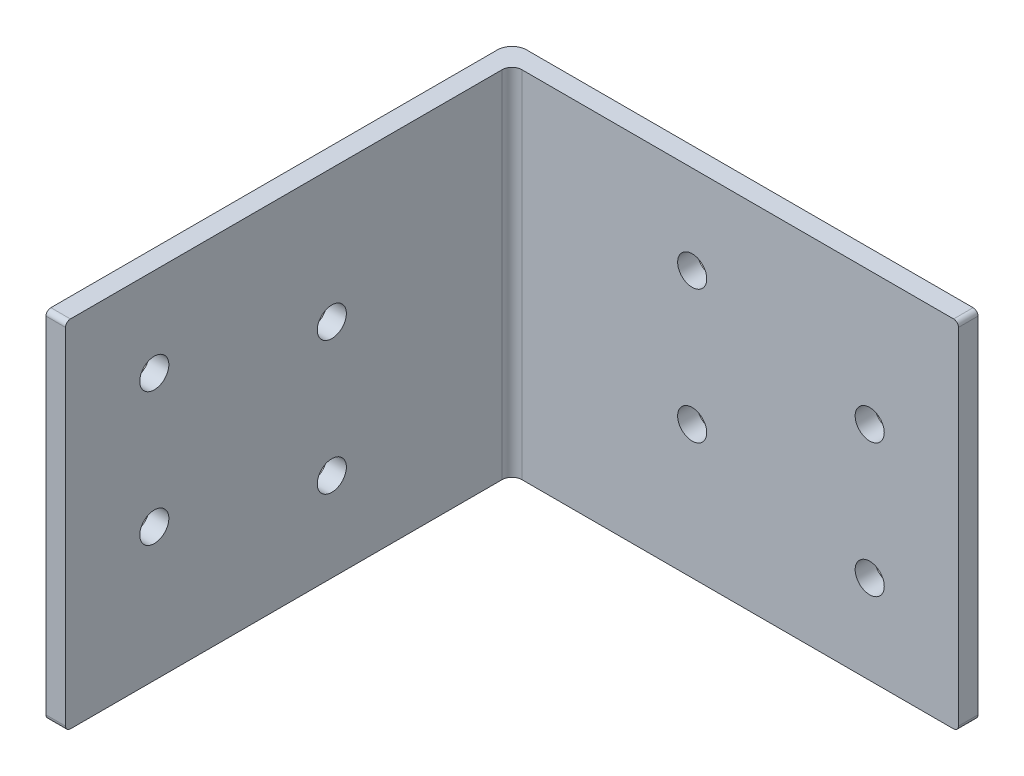
ISO-10303-21;
HEADER;
FILE_DESCRIPTION(('STEP AP214'),'2;1');
FILE_NAME('part.step','',(''),(''),'','','');
FILE_SCHEMA(('AUTOMOTIVE_DESIGN { 1 0 10303 214 1 1 1 1 }'));
ENDSEC;
DATA;
#1=APPLICATION_CONTEXT('core data for automotive mechanical design processes');
#2=APPLICATION_PROTOCOL_DEFINITION('international standard','automotive_design',2000,#1);
#3=PRODUCT_CONTEXT('',#1,'mechanical');
#4=PRODUCT('Part','Part','',(#3));
#5=PRODUCT_RELATED_PRODUCT_CATEGORY('part','',(#4));
#6=PRODUCT_DEFINITION_FORMATION('','',#4);
#7=PRODUCT_DEFINITION_CONTEXT('part definition',#1,'design');
#8=PRODUCT_DEFINITION('design','',#6,#7);
#9=PRODUCT_DEFINITION_SHAPE('','',#8);
#10=(LENGTH_UNIT() NAMED_UNIT(*) SI_UNIT(.MILLI.,.METRE.));
#11=(NAMED_UNIT(*) PLANE_ANGLE_UNIT() SI_UNIT($,.RADIAN.));
#12=(NAMED_UNIT(*) SI_UNIT($,.STERADIAN.) SOLID_ANGLE_UNIT());
#13=UNCERTAINTY_MEASURE_WITH_UNIT(LENGTH_MEASURE(1.E-05),#10,'distance_accuracy_value','');
#14=(GEOMETRIC_REPRESENTATION_CONTEXT(3) GLOBAL_UNCERTAINTY_ASSIGNED_CONTEXT((#13)) GLOBAL_UNIT_ASSIGNED_CONTEXT((#10,
#11,#12)) REPRESENTATION_CONTEXT('',''));
#15=CARTESIAN_POINT('',(0.,0.,0.));
#16=DIRECTION('',(0.,0.,1.));
#17=DIRECTION('',(1.,0.,0.));
#18=AXIS2_PLACEMENT_3D('',#15,#16,#17);
#19=CARTESIAN_POINT('',(1.39700000000002,25.4,65.278));
#20=DIRECTION('',(-1.,0.,0.));
#21=DIRECTION('',(0.,0.,1.));
#22=AXIS2_PLACEMENT_3D('',#19,#20,#21);
#23=PLANE('',#22);
#24=CARTESIAN_POINT('',(1.39700000000002,12.7,52.578));
#25=DIRECTION('',(1.,0.,0.));
#26=DIRECTION('',(0.,0.,-1.));
#27=AXIS2_PLACEMENT_3D('',#24,#25,#26);
#28=CIRCLE('',#27,2.0828);
#29=CARTESIAN_POINT('',(1.39700000000002,12.7,50.4952));
#30=VERTEX_POINT('',#29);
#31=EDGE_CURVE('E239',#30,#30,#28,.T.);
#32=ORIENTED_EDGE('',*,*,#31,.F.);
#33=EDGE_LOOP('',(#32));
#34=FACE_BOUND('',#33,.T.);
#35=CARTESIAN_POINT('',(1.39700000000002,-12.7,27.178));
#36=DIRECTION('',(1.,0.,0.));
#37=DIRECTION('',(0.,0.,-1.));
#38=AXIS2_PLACEMENT_3D('',#35,#36,#37);
#39=CIRCLE('',#38,2.08279999999999);
#40=CARTESIAN_POINT('',(1.39700000000002,-12.7,25.0952));
#41=VERTEX_POINT('',#40);
#42=EDGE_CURVE('E238',#41,#41,#39,.T.);
#43=ORIENTED_EDGE('',*,*,#42,.F.);
#44=EDGE_LOOP('',(#43));
#45=FACE_BOUND('',#44,.T.);
#46=CARTESIAN_POINT('',(1.39700000000002,6.35,27.178));
#47=DIRECTION('',(1.,0.,0.));
#48=DIRECTION('',(0.,0.,-1.));
#49=AXIS2_PLACEMENT_3D('',#46,#47,#48);
#50=CIRCLE('',#49,2.08279999999999);
#51=CARTESIAN_POINT('',(1.39700000000002,6.35,25.0952));
#52=VERTEX_POINT('',#51);
#53=EDGE_CURVE('E246',#52,#52,#50,.T.);
#54=ORIENTED_EDGE('',*,*,#53,.F.);
#55=EDGE_LOOP('',(#54));
#56=FACE_BOUND('',#55,.T.);
#57=CARTESIAN_POINT('',(1.39700000000002,-6.35,52.578));
#58=DIRECTION('',(1.,0.,0.));
#59=DIRECTION('',(0.,0.,-1.));
#60=AXIS2_PLACEMENT_3D('',#57,#58,#59);
#61=CIRCLE('',#60,2.0828);
#62=CARTESIAN_POINT('',(1.39700000000002,-6.35,50.4952));
#63=VERTEX_POINT('',#62);
#64=EDGE_CURVE('E227',#63,#63,#61,.T.);
#65=ORIENTED_EDGE('',*,*,#64,.F.);
#66=EDGE_LOOP('',(#65));
#67=FACE_BOUND('',#66,.T.);
#68=DIRECTION('',(0.,-1.,0.));
#69=VECTOR('',#68,1.);
#70=CARTESIAN_POINT('',(1.39700000000002,25.4,65.278));
#71=LINE('',#70,#69);
#72=CARTESIAN_POINT('',(1.39700000000002,24.7015,65.278));
#73=VERTEX_POINT('',#72);
#74=CARTESIAN_POINT('',(1.39700000000002,-24.7015,65.278));
#75=VERTEX_POINT('',#74);
#76=EDGE_CURVE('E153',#73,#75,#71,.T.);
#77=ORIENTED_EDGE('',*,*,#76,.T.);
#78=CARTESIAN_POINT('',(1.39700000000002,-24.7015,64.5795));
#79=DIRECTION('',(-1.,0.,0.));
#80=DIRECTION('',(0.,0.,1.));
#81=AXIS2_PLACEMENT_3D('',#78,#79,#80);
#82=CIRCLE('',#81,0.6985);
#83=CARTESIAN_POINT('',(1.39700000000002,-25.4,64.5795));
#84=VERTEX_POINT('',#83);
#85=EDGE_CURVE('E205',#75,#84,#82,.F.);
#86=ORIENTED_EDGE('',*,*,#85,.T.);
#87=DIRECTION('',(0.,0.,-1.));
#88=VECTOR('',#87,1.);
#89=CARTESIAN_POINT('',(1.39700000000002,-25.4,65.278));
#90=LINE('',#89,#88);
#91=CARTESIAN_POINT('',(1.39700000000002,-25.4,2.79400000000001));
#92=VERTEX_POINT('',#91);
#93=EDGE_CURVE('E220',#84,#92,#90,.T.);
#94=ORIENTED_EDGE('',*,*,#93,.T.);
#95=DIRECTION('',(0.,-1.,0.));
#96=VECTOR('',#95,1.);
#97=CARTESIAN_POINT('',(1.39700000000002,25.4,2.79400000000001));
#98=LINE('',#97,#96);
#99=CARTESIAN_POINT('',(1.39700000000002,25.4,2.79400000000001));
#100=VERTEX_POINT('',#99);
#101=EDGE_CURVE('E169',#92,#100,#98,.F.);
#102=ORIENTED_EDGE('',*,*,#101,.T.);
#103=DIRECTION('',(0.,0.,-1.));
#104=VECTOR('',#103,1.);
#105=CARTESIAN_POINT('',(1.39700000000002,25.4,65.278));
#106=LINE('',#105,#104);
#107=CARTESIAN_POINT('',(1.39700000000002,25.4,64.5795));
#108=VERTEX_POINT('',#107);
#109=EDGE_CURVE('E144',#108,#100,#106,.T.);
#110=ORIENTED_EDGE('',*,*,#109,.F.);
#111=CARTESIAN_POINT('',(1.39700000000002,24.7015,64.5795));
#112=DIRECTION('',(-1.,0.,0.));
#113=DIRECTION('',(0.,0.,1.));
#114=AXIS2_PLACEMENT_3D('',#111,#112,#113);
#115=CIRCLE('',#114,0.6985);
#116=EDGE_CURVE('E203',#108,#73,#115,.F.);
#117=ORIENTED_EDGE('',*,*,#116,.T.);
#118=EDGE_LOOP('',(#77,#86,#94,#102,#110,#117));
#119=FACE_BOUND('',#118,.T.);
#120=ADVANCED_FACE('F32',(#34,#45,#56,#67,#119),#23,.F.);
#121=CARTESIAN_POINT('',(1.39700000000002,25.4,1.39700000000001));
#122=DIRECTION('',(0.,0.,-1.));
#123=DIRECTION('',(-1.,0.,0.));
#124=AXIS2_PLACEMENT_3D('',#121,#122,#123);
#125=PLANE('',#124);
#126=CARTESIAN_POINT('',(27.178,12.7,1.39700000000001));
#127=DIRECTION('',(0.,0.,1.));
#128=DIRECTION('',(1.,0.,0.));
#129=AXIS2_PLACEMENT_3D('',#126,#127,#128);
#130=CIRCLE('',#129,2.0828);
#131=CARTESIAN_POINT('',(29.2608,12.7,1.39700000000001));
#132=VERTEX_POINT('',#131);
#133=EDGE_CURVE('E269',#132,#132,#130,.T.);
#134=ORIENTED_EDGE('',*,*,#133,.F.);
#135=EDGE_LOOP('',(#134));
#136=FACE_BOUND('',#135,.T.);
#137=CARTESIAN_POINT('',(27.178,-6.35,1.39700000000001));
#138=DIRECTION('',(0.,0.,1.));
#139=DIRECTION('',(1.,0.,0.));
#140=AXIS2_PLACEMENT_3D('',#137,#138,#139);
#141=CIRCLE('',#140,2.0828);
#142=CARTESIAN_POINT('',(29.2608,-6.35,1.39700000000001));
#143=VERTEX_POINT('',#142);
#144=EDGE_CURVE('E263',#143,#143,#141,.T.);
#145=ORIENTED_EDGE('',*,*,#144,.F.);
#146=EDGE_LOOP('',(#145));
#147=FACE_BOUND('',#146,.T.);
#148=CARTESIAN_POINT('',(52.578,-12.7,1.39700000000001));
#149=DIRECTION('',(0.,0.,1.));
#150=DIRECTION('',(1.,0.,0.));
#151=AXIS2_PLACEMENT_3D('',#148,#149,#150);
#152=CIRCLE('',#151,2.0828);
#153=CARTESIAN_POINT('',(54.6608,-12.7,1.39700000000001));
#154=VERTEX_POINT('',#153);
#155=EDGE_CURVE('E256',#154,#154,#152,.T.);
#156=ORIENTED_EDGE('',*,*,#155,.F.);
#157=EDGE_LOOP('',(#156));
#158=FACE_BOUND('',#157,.T.);
#159=CARTESIAN_POINT('',(52.578,6.35,1.39700000000001));
#160=DIRECTION('',(0.,0.,1.));
#161=DIRECTION('',(1.,0.,0.));
#162=AXIS2_PLACEMENT_3D('',#159,#160,#161);
#163=CIRCLE('',#162,2.0828);
#164=CARTESIAN_POINT('',(54.6608,6.35,1.39700000000001));
#165=VERTEX_POINT('',#164);
#166=EDGE_CURVE('E257',#165,#165,#163,.T.);
#167=ORIENTED_EDGE('',*,*,#166,.F.);
#168=EDGE_LOOP('',(#167));
#169=FACE_BOUND('',#168,.T.);
#170=DIRECTION('',(1.,0.,0.));
#171=VECTOR('',#170,1.);
#172=CARTESIAN_POINT('',(1.39700000000002,-25.4,1.39700000000001));
#173=LINE('',#172,#171);
#174=CARTESIAN_POINT('',(2.79400000000002,-25.4,1.39700000000001));
#175=VERTEX_POINT('',#174);
#176=CARTESIAN_POINT('',(64.5795,-25.4,1.39700000000002));
#177=VERTEX_POINT('',#176);
#178=EDGE_CURVE('E149',#175,#177,#173,.T.);
#179=ORIENTED_EDGE('',*,*,#178,.T.);
#180=CARTESIAN_POINT('',(64.5795,-24.7015,1.39700000000002));
#181=DIRECTION('',(0.,0.,-1.));
#182=DIRECTION('',(-1.,0.,0.));
#183=AXIS2_PLACEMENT_3D('',#180,#181,#182);
#184=CIRCLE('',#183,0.6985);
#185=CARTESIAN_POINT('',(65.278,-24.7015,1.39700000000002));
#186=VERTEX_POINT('',#185);
#187=EDGE_CURVE('E191',#177,#186,#184,.F.);
#188=ORIENTED_EDGE('',*,*,#187,.T.);
#189=DIRECTION('',(0.,-1.,0.));
#190=VECTOR('',#189,1.);
#191=CARTESIAN_POINT('',(65.278,25.4,1.39700000000002));
#192=LINE('',#191,#190);
#193=CARTESIAN_POINT('',(65.278,24.7015,1.39700000000002));
#194=VERTEX_POINT('',#193);
#195=EDGE_CURVE('E138',#194,#186,#192,.T.);
#196=ORIENTED_EDGE('',*,*,#195,.F.);
#197=CARTESIAN_POINT('',(64.5795,24.7015,1.39700000000002));
#198=DIRECTION('',(0.,0.,-1.));
#199=DIRECTION('',(-1.,0.,0.));
#200=AXIS2_PLACEMENT_3D('',#197,#198,#199);
#201=CIRCLE('',#200,0.6985);
#202=CARTESIAN_POINT('',(64.5795,25.4,1.39700000000002));
#203=VERTEX_POINT('',#202);
#204=EDGE_CURVE('E189',#194,#203,#201,.F.);
#205=ORIENTED_EDGE('',*,*,#204,.T.);
#206=DIRECTION('',(1.,0.,0.));
#207=VECTOR('',#206,1.);
#208=CARTESIAN_POINT('',(1.39700000000002,25.4,1.39700000000001));
#209=LINE('',#208,#207);
#210=CARTESIAN_POINT('',(2.79400000000002,25.4,1.39700000000001));
#211=VERTEX_POINT('',#210);
#212=EDGE_CURVE('E147',#211,#203,#209,.T.);
#213=ORIENTED_EDGE('',*,*,#212,.F.);
#214=DIRECTION('',(0.,-1.,0.));
#215=VECTOR('',#214,1.);
#216=CARTESIAN_POINT('',(2.79400000000002,-25.4,1.39700000000001));
#217=LINE('',#216,#215);
#218=EDGE_CURVE('E166',#211,#175,#217,.T.);
#219=ORIENTED_EDGE('',*,*,#218,.T.);
#220=EDGE_LOOP('',(#179,#188,#196,#205,#213,#219));
#221=FACE_BOUND('',#220,.T.);
#222=ADVANCED_FACE('F280',(#136,#147,#158,#169,#221),#125,.F.);
#223=CARTESIAN_POINT('',(65.278,25.4,1.39700000000002));
#224=DIRECTION('',(-1.,0.,0.));
#225=DIRECTION('',(0.,0.,1.));
#226=AXIS2_PLACEMENT_3D('',#223,#224,#225);
#227=PLANE('',#226);
#228=ORIENTED_EDGE('',*,*,#195,.T.);
#229=DIRECTION('',(0.,0.,-1.));
#230=VECTOR('',#229,1.);
#231=CARTESIAN_POINT('',(65.278,-24.7015,-1.39700000000001));
#232=LINE('',#231,#230);
#233=CARTESIAN_POINT('',(65.278,-24.7015,-1.39700000000001));
#234=VERTEX_POINT('',#233);
#235=EDGE_CURVE('E179',#186,#234,#232,.T.);
#236=ORIENTED_EDGE('',*,*,#235,.T.);
#237=DIRECTION('',(0.,-1.,0.));
#238=VECTOR('',#237,1.);
#239=CARTESIAN_POINT('',(65.278,25.4,-1.39700000000001));
#240=LINE('',#239,#238);
#241=CARTESIAN_POINT('',(65.278,24.7015,-1.39700000000001));
#242=VERTEX_POINT('',#241);
#243=EDGE_CURVE('E158',#242,#234,#240,.T.);
#244=ORIENTED_EDGE('',*,*,#243,.F.);
#245=DIRECTION('',(0.,0.,-1.));
#246=VECTOR('',#245,1.);
#247=CARTESIAN_POINT('',(65.278,24.7015,1.39700000000002));
#248=LINE('',#247,#246);
#249=EDGE_CURVE('E177',#242,#194,#248,.F.);
#250=ORIENTED_EDGE('',*,*,#249,.T.);
#251=EDGE_LOOP('',(#228,#236,#244,#250));
#252=FACE_BOUND('',#251,.T.);
#253=ADVANCED_FACE('F283',(#252),#227,.F.);
#254=CARTESIAN_POINT('',(65.278,25.4,-1.39700000000001));
#255=DIRECTION('',(0.,0.,1.));
#256=DIRECTION('',(1.,0.,0.));
#257=AXIS2_PLACEMENT_3D('',#254,#255,#256);
#258=PLANE('',#257);
#259=CARTESIAN_POINT('',(27.178,12.7,-1.397));
#260=DIRECTION('',(0.,0.,1.));
#261=DIRECTION('',(1.,0.,0.));
#262=AXIS2_PLACEMENT_3D('',#259,#260,#261);
#263=CIRCLE('',#262,2.0828);
#264=CARTESIAN_POINT('',(29.2608,12.7,-1.397));
#265=VERTEX_POINT('',#264);
#266=EDGE_CURVE('E242',#265,#265,#263,.F.);
#267=ORIENTED_EDGE('',*,*,#266,.F.);
#268=EDGE_LOOP('',(#267));
#269=FACE_BOUND('',#268,.T.);
#270=CARTESIAN_POINT('',(27.178,-6.35,-1.397));
#271=DIRECTION('',(0.,0.,1.));
#272=DIRECTION('',(1.,0.,0.));
#273=AXIS2_PLACEMENT_3D('',#270,#271,#272);
#274=CIRCLE('',#273,2.0828);
#275=CARTESIAN_POINT('',(29.2608,-6.35,-1.397));
#276=VERTEX_POINT('',#275);
#277=EDGE_CURVE('E266',#276,#276,#274,.F.);
#278=ORIENTED_EDGE('',*,*,#277,.F.);
#279=EDGE_LOOP('',(#278));
#280=FACE_BOUND('',#279,.T.);
#281=CARTESIAN_POINT('',(52.578,-12.7,-1.397));
#282=DIRECTION('',(0.,0.,1.));
#283=DIRECTION('',(1.,0.,0.));
#284=AXIS2_PLACEMENT_3D('',#281,#282,#283);
#285=CIRCLE('',#284,2.0828);
#286=CARTESIAN_POINT('',(54.6608,-12.7,-1.397));
#287=VERTEX_POINT('',#286);
#288=EDGE_CURVE('E260',#287,#287,#285,.F.);
#289=ORIENTED_EDGE('',*,*,#288,.F.);
#290=EDGE_LOOP('',(#289));
#291=FACE_BOUND('',#290,.T.);
#292=CARTESIAN_POINT('',(52.578,6.35,-1.397));
#293=DIRECTION('',(0.,0.,1.));
#294=DIRECTION('',(1.,0.,0.));
#295=AXIS2_PLACEMENT_3D('',#292,#293,#294);
#296=CIRCLE('',#295,2.0828);
#297=CARTESIAN_POINT('',(54.6608,6.35,-1.397));
#298=VERTEX_POINT('',#297);
#299=EDGE_CURVE('E253',#298,#298,#296,.F.);
#300=ORIENTED_EDGE('',*,*,#299,.F.);
#301=EDGE_LOOP('',(#300));
#302=FACE_BOUND('',#301,.T.);
#303=ORIENTED_EDGE('',*,*,#243,.T.);
#304=CARTESIAN_POINT('',(64.5795,-24.7015,-1.39700000000001));
#305=DIRECTION('',(0.,0.,1.));
#306=DIRECTION('',(1.,0.,0.));
#307=AXIS2_PLACEMENT_3D('',#304,#305,#306);
#308=CIRCLE('',#307,0.6985);
#309=CARTESIAN_POINT('',(64.5795,-25.4,-1.39700000000001));
#310=VERTEX_POINT('',#309);
#311=EDGE_CURVE('E184',#234,#310,#308,.F.);
#312=ORIENTED_EDGE('',*,*,#311,.T.);
#313=DIRECTION('',(-1.,0.,0.));
#314=VECTOR('',#313,1.);
#315=CARTESIAN_POINT('',(65.278,-25.4,-1.39700000000001));
#316=LINE('',#315,#314);
#317=CARTESIAN_POINT('',(0.698499999999991,-25.4,-1.39699999999999));
#318=VERTEX_POINT('',#317);
#319=EDGE_CURVE('E145',#310,#318,#316,.T.);
#320=ORIENTED_EDGE('',*,*,#319,.T.);
#321=DIRECTION('',(0.,-1.,0.));
#322=VECTOR('',#321,1.);
#323=CARTESIAN_POINT('',(0.698499999999991,25.4,-1.39699999999999));
#324=LINE('',#323,#322);
#325=CARTESIAN_POINT('',(0.698499999999991,25.4,-1.39699999999999));
#326=VERTEX_POINT('',#325);
#327=EDGE_CURVE('E128',#318,#326,#324,.F.);
#328=ORIENTED_EDGE('',*,*,#327,.T.);
#329=DIRECTION('',(-1.,0.,0.));
#330=VECTOR('',#329,1.);
#331=CARTESIAN_POINT('',(65.278,25.4,-1.39700000000001));
#332=LINE('',#331,#330);
#333=CARTESIAN_POINT('',(64.5795,25.4,-1.39700000000001));
#334=VERTEX_POINT('',#333);
#335=EDGE_CURVE('E213',#334,#326,#332,.T.);
#336=ORIENTED_EDGE('',*,*,#335,.F.);
#337=CARTESIAN_POINT('',(64.5795,24.7015,-1.39700000000001));
#338=DIRECTION('',(0.,0.,1.));
#339=DIRECTION('',(1.,0.,0.));
#340=AXIS2_PLACEMENT_3D('',#337,#338,#339);
#341=CIRCLE('',#340,0.6985);
#342=EDGE_CURVE('E182',#334,#242,#341,.F.);
#343=ORIENTED_EDGE('',*,*,#342,.T.);
#344=EDGE_LOOP('',(#303,#312,#320,#328,#336,#343));
#345=FACE_BOUND('',#344,.T.);
#346=ADVANCED_FACE('F303',(#269,#280,#291,#302,#345),#258,.F.);
#347=CARTESIAN_POINT('',(-1.39700000000001,25.4,-1.39699999999999));
#348=DIRECTION('',(1.,0.,0.));
#349=DIRECTION('',(0.,0.,-1.));
#350=AXIS2_PLACEMENT_3D('',#347,#348,#349);
#351=PLANE('',#350);
#352=CARTESIAN_POINT('',(-1.39700000000001,12.7,52.578));
#353=DIRECTION('',(1.,0.,0.));
#354=DIRECTION('',(0.,0.,-1.));
#355=AXIS2_PLACEMENT_3D('',#352,#353,#354);
#356=CIRCLE('',#355,2.0828);
#357=CARTESIAN_POINT('',(-1.39700000000001,12.7,50.4952));
#358=VERTEX_POINT('',#357);
#359=EDGE_CURVE('E235',#358,#358,#356,.F.);
#360=ORIENTED_EDGE('',*,*,#359,.F.);
#361=EDGE_LOOP('',(#360));
#362=FACE_BOUND('',#361,.T.);
#363=CARTESIAN_POINT('',(-1.39700000000001,-12.7,27.178));
#364=DIRECTION('',(1.,0.,0.));
#365=DIRECTION('',(0.,0.,-1.));
#366=AXIS2_PLACEMENT_3D('',#363,#364,#365);
#367=CIRCLE('',#366,2.08279999999999);
#368=CARTESIAN_POINT('',(-1.39700000000001,-12.7,25.0952));
#369=VERTEX_POINT('',#368);
#370=EDGE_CURVE('E243',#369,#369,#367,.F.);
#371=ORIENTED_EDGE('',*,*,#370,.F.);
#372=EDGE_LOOP('',(#371));
#373=FACE_BOUND('',#372,.T.);
#374=CARTESIAN_POINT('',(-1.39700000000001,6.35,27.178));
#375=DIRECTION('',(1.,0.,0.));
#376=DIRECTION('',(0.,0.,-1.));
#377=AXIS2_PLACEMENT_3D('',#374,#375,#376);
#378=CIRCLE('',#377,2.08279999999999);
#379=CARTESIAN_POINT('',(-1.39700000000001,6.35,25.0952));
#380=VERTEX_POINT('',#379);
#381=EDGE_CURVE('E234',#380,#380,#378,.F.);
#382=ORIENTED_EDGE('',*,*,#381,.F.);
#383=EDGE_LOOP('',(#382));
#384=FACE_BOUND('',#383,.T.);
#385=CARTESIAN_POINT('',(-1.39700000000001,-6.35,52.578));
#386=DIRECTION('',(1.,0.,0.));
#387=DIRECTION('',(0.,0.,-1.));
#388=AXIS2_PLACEMENT_3D('',#385,#386,#387);
#389=CIRCLE('',#388,2.0828);
#390=CARTESIAN_POINT('',(-1.39700000000001,-6.35,50.4952));
#391=VERTEX_POINT('',#390);
#392=EDGE_CURVE('E223',#391,#391,#389,.F.);
#393=ORIENTED_EDGE('',*,*,#392,.F.);
#394=EDGE_LOOP('',(#393));
#395=FACE_BOUND('',#394,.T.);
#396=DIRECTION('',(0.,0.,1.));
#397=VECTOR('',#396,1.);
#398=CARTESIAN_POINT('',(-1.39700000000001,-25.4,-1.39699999999999));
#399=LINE('',#398,#397);
#400=CARTESIAN_POINT('',(-1.39700000000001,-25.4,0.698500000000012));
#401=VERTEX_POINT('',#400);
#402=CARTESIAN_POINT('',(-1.39700000000001,-25.4,64.5795));
#403=VERTEX_POINT('',#402);
#404=EDGE_CURVE('E135',#401,#403,#399,.T.);
#405=ORIENTED_EDGE('',*,*,#404,.T.);
#406=CARTESIAN_POINT('',(-1.39700000000001,-24.7015,64.5795));
#407=DIRECTION('',(1.,0.,0.));
#408=DIRECTION('',(0.,0.,-1.));
#409=AXIS2_PLACEMENT_3D('',#406,#407,#408);
#410=CIRCLE('',#409,0.6985);
#411=CARTESIAN_POINT('',(-1.39700000000001,-24.7015,65.278));
#412=VERTEX_POINT('',#411);
#413=EDGE_CURVE('E11',#403,#412,#410,.F.);
#414=ORIENTED_EDGE('',*,*,#413,.T.);
#415=DIRECTION('',(0.,-1.,0.));
#416=VECTOR('',#415,1.);
#417=CARTESIAN_POINT('',(-1.39700000000001,25.4,65.278));
#418=LINE('',#417,#416);
#419=CARTESIAN_POINT('',(-1.39700000000001,24.7015,65.278));
#420=VERTEX_POINT('',#419);
#421=EDGE_CURVE('E156',#420,#412,#418,.T.);
#422=ORIENTED_EDGE('',*,*,#421,.F.);
#423=CARTESIAN_POINT('',(-1.39700000000001,24.7015,64.5795));
#424=DIRECTION('',(1.,0.,0.));
#425=DIRECTION('',(0.,0.,-1.));
#426=AXIS2_PLACEMENT_3D('',#423,#424,#425);
#427=CIRCLE('',#426,0.6985);
#428=CARTESIAN_POINT('',(-1.39700000000001,25.4,64.5795));
#429=VERTEX_POINT('',#428);
#430=EDGE_CURVE('E40',#420,#429,#427,.F.);
#431=ORIENTED_EDGE('',*,*,#430,.T.);
#432=DIRECTION('',(0.,0.,1.));
#433=VECTOR('',#432,1.);
#434=CARTESIAN_POINT('',(-1.39700000000001,25.4,-1.39699999999999));
#435=LINE('',#434,#433);
#436=CARTESIAN_POINT('',(-1.39700000000001,25.4,0.698500000000012));
#437=VERTEX_POINT('',#436);
#438=EDGE_CURVE('E137',#437,#429,#435,.T.);
#439=ORIENTED_EDGE('',*,*,#438,.F.);
#440=DIRECTION('',(0.,-1.,0.));
#441=VECTOR('',#440,1.);
#442=CARTESIAN_POINT('',(-1.39700000000001,25.4,0.698500000000012));
#443=LINE('',#442,#441);
#444=EDGE_CURVE('E126',#437,#401,#443,.T.);
#445=ORIENTED_EDGE('',*,*,#444,.T.);
#446=EDGE_LOOP('',(#405,#414,#422,#431,#439,#445));
#447=FACE_BOUND('',#446,.T.);
#448=ADVANCED_FACE('F134',(#362,#373,#384,#395,#447),#351,.F.);
#449=CARTESIAN_POINT('',(-1.39700000000001,25.4,65.278));
#450=DIRECTION('',(0.,0.,-1.));
#451=DIRECTION('',(-1.,0.,0.));
#452=AXIS2_PLACEMENT_3D('',#449,#450,#451);
#453=PLANE('',#452);
#454=ORIENTED_EDGE('',*,*,#421,.T.);
#455=DIRECTION('',(1.,0.,0.));
#456=VECTOR('',#455,1.);
#457=CARTESIAN_POINT('',(1.39700000000002,-24.7015,65.278));
#458=LINE('',#457,#456);
#459=EDGE_CURVE('E200',#412,#75,#458,.T.);
#460=ORIENTED_EDGE('',*,*,#459,.T.);
#461=ORIENTED_EDGE('',*,*,#76,.F.);
#462=DIRECTION('',(1.,0.,0.));
#463=VECTOR('',#462,1.);
#464=CARTESIAN_POINT('',(-1.39700000000001,24.7015,65.278));
#465=LINE('',#464,#463);
#466=EDGE_CURVE('E52',#73,#420,#465,.F.);
#467=ORIENTED_EDGE('',*,*,#466,.T.);
#468=EDGE_LOOP('',(#454,#460,#461,#467));
#469=FACE_BOUND('',#468,.T.);
#470=ADVANCED_FACE('F216',(#469),#453,.F.);
#471=CARTESIAN_POINT('',(0.,25.4,0.));
#472=DIRECTION('',(0.,-1.,0.));
#473=DIRECTION('',(0.,0.,-1.));
#474=AXIS2_PLACEMENT_3D('',#471,#472,#473);
#475=PLANE('',#474);
#476=ORIENTED_EDGE('',*,*,#212,.T.);
#477=DIRECTION('',(0.,0.,-1.));
#478=VECTOR('',#477,1.);
#479=CARTESIAN_POINT('',(64.5795,25.4,0.));
#480=LINE('',#479,#478);
#481=EDGE_CURVE('E196',#203,#334,#480,.T.);
#482=ORIENTED_EDGE('',*,*,#481,.T.);
#483=ORIENTED_EDGE('',*,*,#335,.T.);
#484=CARTESIAN_POINT('',(0.698499999999988,25.4,0.698500000000012));
#485=DIRECTION('',(0.,-1.,0.));
#486=DIRECTION('',(0.,0.,-1.));
#487=AXIS2_PLACEMENT_3D('',#484,#485,#486);
#488=CIRCLE('',#487,2.0955);
#489=EDGE_CURVE('E164',#326,#437,#488,.F.);
#490=ORIENTED_EDGE('',*,*,#489,.T.);
#491=ORIENTED_EDGE('',*,*,#438,.T.);
#492=DIRECTION('',(1.,0.,0.));
#493=VECTOR('',#492,1.);
#494=CARTESIAN_POINT('',(0.,25.4,64.5795));
#495=LINE('',#494,#493);
#496=EDGE_CURVE('E193',#429,#108,#495,.T.);
#497=ORIENTED_EDGE('',*,*,#496,.T.);
#498=ORIENTED_EDGE('',*,*,#109,.T.);
#499=CARTESIAN_POINT('',(2.79400000000002,25.4,2.79400000000001));
#500=DIRECTION('',(0.,-1.,0.));
#501=DIRECTION('',(0.,0.,-1.));
#502=AXIS2_PLACEMENT_3D('',#499,#500,#501);
#503=CIRCLE('',#502,1.397);
#504=EDGE_CURVE('E175',#100,#211,#503,.T.);
#505=ORIENTED_EDGE('',*,*,#504,.T.);
#506=EDGE_LOOP('',(#476,#482,#483,#490,#491,#497,#498,#505));
#507=FACE_BOUND('',#506,.T.);
#508=ADVANCED_FACE('F211',(#507),#475,.F.);
#509=CARTESIAN_POINT('',(0.,-25.4,0.));
#510=DIRECTION('',(0.,-1.,0.));
#511=DIRECTION('',(0.,0.,-1.));
#512=AXIS2_PLACEMENT_3D('',#509,#510,#511);
#513=PLANE('',#512);
#514=ORIENTED_EDGE('',*,*,#319,.F.);
#515=DIRECTION('',(0.,0.,-1.));
#516=VECTOR('',#515,1.);
#517=CARTESIAN_POINT('',(64.5795,-25.4,1.39700000000002));
#518=LINE('',#517,#516);
#519=EDGE_CURVE('E187',#310,#177,#518,.F.);
#520=ORIENTED_EDGE('',*,*,#519,.T.);
#521=ORIENTED_EDGE('',*,*,#178,.F.);
#522=CARTESIAN_POINT('',(2.79400000000002,-25.4,2.79400000000001));
#523=DIRECTION('',(0.,-1.,0.));
#524=DIRECTION('',(0.,0.,-1.));
#525=AXIS2_PLACEMENT_3D('',#522,#523,#524);
#526=CIRCLE('',#525,1.397);
#527=EDGE_CURVE('E172',#175,#92,#526,.F.);
#528=ORIENTED_EDGE('',*,*,#527,.T.);
#529=ORIENTED_EDGE('',*,*,#93,.F.);
#530=DIRECTION('',(1.,0.,0.));
#531=VECTOR('',#530,1.);
#532=CARTESIAN_POINT('',(-1.39700000000001,-25.4,64.5795));
#533=LINE('',#532,#531);
#534=EDGE_CURVE('E143',#84,#403,#533,.F.);
#535=ORIENTED_EDGE('',*,*,#534,.T.);
#536=ORIENTED_EDGE('',*,*,#404,.F.);
#537=CARTESIAN_POINT('',(0.698499999999988,-25.4,0.698500000000012));
#538=DIRECTION('',(0.,-1.,0.));
#539=DIRECTION('',(0.,0.,-1.));
#540=AXIS2_PLACEMENT_3D('',#537,#538,#539);
#541=CIRCLE('',#540,2.0955);
#542=EDGE_CURVE('E122',#401,#318,#541,.T.);
#543=ORIENTED_EDGE('',*,*,#542,.T.);
#544=EDGE_LOOP('',(#514,#520,#521,#528,#529,#535,#536,#543));
#545=FACE_BOUND('',#544,.T.);
#546=ADVANCED_FACE('F140',(#545),#513,.T.);
#547=CARTESIAN_POINT('',(0.698499999999988,25.4,0.698500000000012));
#548=DIRECTION('',(0.,-1.,0.));
#549=DIRECTION('',(0.,0.,-1.));
#550=AXIS2_PLACEMENT_3D('',#547,#548,#549);
#551=CYLINDRICAL_SURFACE('',#550,2.0955);
#552=ORIENTED_EDGE('',*,*,#489,.F.);
#553=ORIENTED_EDGE('',*,*,#327,.F.);
#554=ORIENTED_EDGE('',*,*,#542,.F.);
#555=ORIENTED_EDGE('',*,*,#444,.F.);
#556=EDGE_LOOP('',(#552,#553,#554,#555));
#557=FACE_BOUND('',#556,.T.);
#558=ADVANCED_FACE('F125',(#557),#551,.T.);
#559=CARTESIAN_POINT('',(2.79400000000002,25.4,2.79400000000001));
#560=DIRECTION('',(0.,1.,0.));
#561=DIRECTION('',(0.,0.,1.));
#562=AXIS2_PLACEMENT_3D('',#559,#560,#561);
#563=CYLINDRICAL_SURFACE('',#562,1.397);
#564=ORIENTED_EDGE('',*,*,#504,.F.);
#565=ORIENTED_EDGE('',*,*,#101,.F.);
#566=ORIENTED_EDGE('',*,*,#527,.F.);
#567=ORIENTED_EDGE('',*,*,#218,.F.);
#568=EDGE_LOOP('',(#564,#565,#566,#567));
#569=FACE_BOUND('',#568,.T.);
#570=ADVANCED_FACE('F311',(#569),#563,.F.);
#571=CARTESIAN_POINT('',(64.5795,-24.7015,1.39700000000002));
#572=DIRECTION('',(0.,0.,1.));
#573=DIRECTION('',(1.,0.,0.));
#574=AXIS2_PLACEMENT_3D('',#571,#572,#573);
#575=CYLINDRICAL_SURFACE('',#574,0.6985);
#576=ORIENTED_EDGE('',*,*,#187,.F.);
#577=ORIENTED_EDGE('',*,*,#519,.F.);
#578=ORIENTED_EDGE('',*,*,#311,.F.);
#579=ORIENTED_EDGE('',*,*,#235,.F.);
#580=EDGE_LOOP('',(#576,#577,#578,#579));
#581=FACE_BOUND('',#580,.T.);
#582=ADVANCED_FACE('F298',(#581),#575,.T.);
#583=CARTESIAN_POINT('',(64.5795,24.7015,0.));
#584=DIRECTION('',(0.,0.,-1.));
#585=DIRECTION('',(-1.,0.,0.));
#586=AXIS2_PLACEMENT_3D('',#583,#584,#585);
#587=CYLINDRICAL_SURFACE('',#586,0.6985);
#588=ORIENTED_EDGE('',*,*,#204,.F.);
#589=ORIENTED_EDGE('',*,*,#249,.F.);
#590=ORIENTED_EDGE('',*,*,#342,.F.);
#591=ORIENTED_EDGE('',*,*,#481,.F.);
#592=EDGE_LOOP('',(#588,#589,#590,#591));
#593=FACE_BOUND('',#592,.T.);
#594=ADVANCED_FACE('F308',(#593),#587,.T.);
#595=CARTESIAN_POINT('',(-1.39700000000001,-24.7015,64.5795));
#596=DIRECTION('',(-1.,0.,0.));
#597=DIRECTION('',(0.,0.,1.));
#598=AXIS2_PLACEMENT_3D('',#595,#596,#597);
#599=CYLINDRICAL_SURFACE('',#598,0.6985);
#600=ORIENTED_EDGE('',*,*,#413,.F.);
#601=ORIENTED_EDGE('',*,*,#534,.F.);
#602=ORIENTED_EDGE('',*,*,#85,.F.);
#603=ORIENTED_EDGE('',*,*,#459,.F.);
#604=EDGE_LOOP('',(#600,#601,#602,#603));
#605=FACE_BOUND('',#604,.T.);
#606=ADVANCED_FACE('F219',(#605),#599,.T.);
#607=CARTESIAN_POINT('',(0.,24.7015,64.5795));
#608=DIRECTION('',(1.,0.,0.));
#609=DIRECTION('',(0.,0.,-1.));
#610=AXIS2_PLACEMENT_3D('',#607,#608,#609);
#611=CYLINDRICAL_SURFACE('',#610,0.6985);
#612=ORIENTED_EDGE('',*,*,#430,.F.);
#613=ORIENTED_EDGE('',*,*,#466,.F.);
#614=ORIENTED_EDGE('',*,*,#116,.F.);
#615=ORIENTED_EDGE('',*,*,#496,.F.);
#616=EDGE_LOOP('',(#612,#613,#614,#615));
#617=FACE_BOUND('',#616,.T.);
#618=ADVANCED_FACE('F34',(#617),#611,.T.);
#619=CARTESIAN_POINT('',(-1.39800000000001,-6.35,52.578));
#620=DIRECTION('',(1.,0.,0.));
#621=DIRECTION('',(0.,0.,-1.));
#622=AXIS2_PLACEMENT_3D('',#619,#620,#621);
#623=CYLINDRICAL_SURFACE('',#622,2.0828);
#624=ORIENTED_EDGE('',*,*,#64,.T.);
#625=EDGE_LOOP('',(#624));
#626=FACE_BOUND('',#625,.T.);
#627=ORIENTED_EDGE('',*,*,#392,.T.);
#628=EDGE_LOOP('',(#627));
#629=FACE_BOUND('',#628,.T.);
#630=ADVANCED_FACE('F342',(#626,#629),#623,.F.);
#631=CARTESIAN_POINT('',(-1.39800000000002,6.35,27.178));
#632=DIRECTION('',(1.,0.,0.));
#633=DIRECTION('',(0.,0.,-1.));
#634=AXIS2_PLACEMENT_3D('',#631,#632,#633);
#635=CYLINDRICAL_SURFACE('',#634,2.08279999999999);
#636=ORIENTED_EDGE('',*,*,#53,.T.);
#637=EDGE_LOOP('',(#636));
#638=FACE_BOUND('',#637,.T.);
#639=ORIENTED_EDGE('',*,*,#381,.T.);
#640=EDGE_LOOP('',(#639));
#641=FACE_BOUND('',#640,.T.);
#642=ADVANCED_FACE('F345',(#638,#641),#635,.F.);
#643=CARTESIAN_POINT('',(-1.39800000000002,-12.7,27.178));
#644=DIRECTION('',(1.,0.,0.));
#645=DIRECTION('',(0.,0.,-1.));
#646=AXIS2_PLACEMENT_3D('',#643,#644,#645);
#647=CYLINDRICAL_SURFACE('',#646,2.08279999999999);
#648=ORIENTED_EDGE('',*,*,#42,.T.);
#649=EDGE_LOOP('',(#648));
#650=FACE_BOUND('',#649,.T.);
#651=ORIENTED_EDGE('',*,*,#370,.T.);
#652=EDGE_LOOP('',(#651));
#653=FACE_BOUND('',#652,.T.);
#654=ADVANCED_FACE('F351',(#650,#653),#647,.F.);
#655=CARTESIAN_POINT('',(-1.39800000000001,12.7,52.578));
#656=DIRECTION('',(1.,0.,0.));
#657=DIRECTION('',(0.,0.,-1.));
#658=AXIS2_PLACEMENT_3D('',#655,#656,#657);
#659=CYLINDRICAL_SURFACE('',#658,2.0828);
#660=ORIENTED_EDGE('',*,*,#31,.T.);
#661=EDGE_LOOP('',(#660));
#662=FACE_BOUND('',#661,.T.);
#663=ORIENTED_EDGE('',*,*,#359,.T.);
#664=EDGE_LOOP('',(#663));
#665=FACE_BOUND('',#664,.T.);
#666=ADVANCED_FACE('F347',(#662,#665),#659,.F.);
#667=CARTESIAN_POINT('',(52.578,6.35,-1.39800000000001));
#668=DIRECTION('',(0.,0.,1.));
#669=DIRECTION('',(1.,0.,0.));
#670=AXIS2_PLACEMENT_3D('',#667,#668,#669);
#671=CYLINDRICAL_SURFACE('',#670,2.0828);
#672=ORIENTED_EDGE('',*,*,#166,.T.);
#673=EDGE_LOOP('',(#672));
#674=FACE_BOUND('',#673,.T.);
#675=ORIENTED_EDGE('',*,*,#299,.T.);
#676=EDGE_LOOP('',(#675));
#677=FACE_BOUND('',#676,.T.);
#678=ADVANCED_FACE('F350',(#674,#677),#671,.F.);
#679=CARTESIAN_POINT('',(52.578,-12.7,-1.39800000000001));
#680=DIRECTION('',(0.,0.,1.));
#681=DIRECTION('',(1.,0.,0.));
#682=AXIS2_PLACEMENT_3D('',#679,#680,#681);
#683=CYLINDRICAL_SURFACE('',#682,2.0828);
#684=ORIENTED_EDGE('',*,*,#155,.T.);
#685=EDGE_LOOP('',(#684));
#686=FACE_BOUND('',#685,.T.);
#687=ORIENTED_EDGE('',*,*,#288,.T.);
#688=EDGE_LOOP('',(#687));
#689=FACE_BOUND('',#688,.T.);
#690=ADVANCED_FACE('F361',(#686,#689),#683,.F.);
#691=CARTESIAN_POINT('',(27.178,-6.35,-1.39800000000001));
#692=DIRECTION('',(0.,0.,1.));
#693=DIRECTION('',(1.,0.,0.));
#694=AXIS2_PLACEMENT_3D('',#691,#692,#693);
#695=CYLINDRICAL_SURFACE('',#694,2.0828);
#696=ORIENTED_EDGE('',*,*,#144,.T.);
#697=EDGE_LOOP('',(#696));
#698=FACE_BOUND('',#697,.T.);
#699=ORIENTED_EDGE('',*,*,#277,.T.);
#700=EDGE_LOOP('',(#699));
#701=FACE_BOUND('',#700,.T.);
#702=ADVANCED_FACE('F365',(#698,#701),#695,.F.);
#703=CARTESIAN_POINT('',(27.178,12.7,-1.39800000000001));
#704=DIRECTION('',(0.,0.,1.));
#705=DIRECTION('',(1.,0.,0.));
#706=AXIS2_PLACEMENT_3D('',#703,#704,#705);
#707=CYLINDRICAL_SURFACE('',#706,2.0828);
#708=ORIENTED_EDGE('',*,*,#133,.T.);
#709=EDGE_LOOP('',(#708));
#710=FACE_BOUND('',#709,.T.);
#711=ORIENTED_EDGE('',*,*,#266,.T.);
#712=EDGE_LOOP('',(#711));
#713=FACE_BOUND('',#712,.T.);
#714=ADVANCED_FACE('F277',(#710,#713),#707,.F.);
#715=CLOSED_SHELL('',(#120,#222,#253,#346,#448,#470,#508,#546,#558,#570,#582,#594,#606,#618,
#630,#642,#654,#666,#678,#690,#702,#714));
#716=MANIFOLD_SOLID_BREP('B2',#715);
#717=ADVANCED_BREP_SHAPE_REPRESENTATION('',(#18,#716),#14);
#718=SHAPE_DEFINITION_REPRESENTATION(#9,#717);
ENDSEC;
END-ISO-10303-21;
